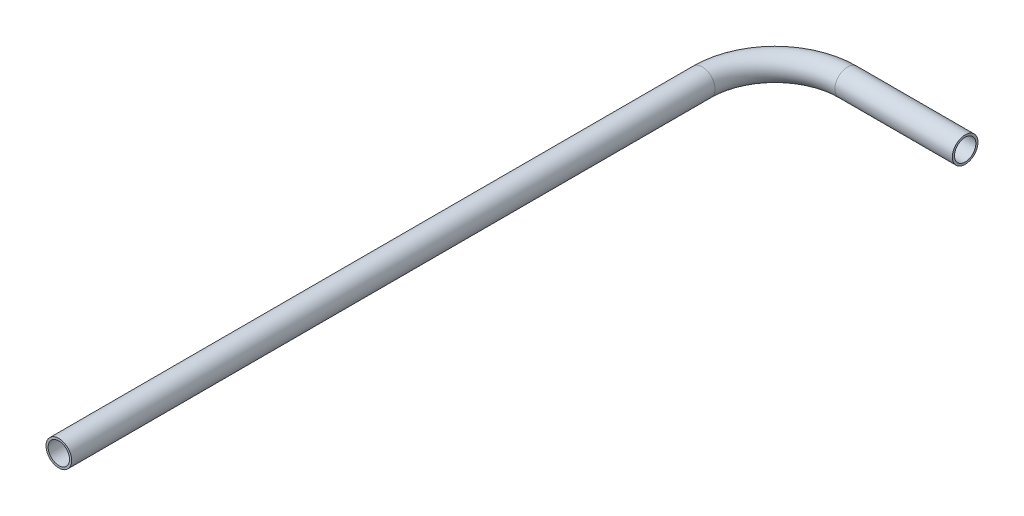
ISO-10303-21;
HEADER;
FILE_DESCRIPTION(('STEP AP214'),'2;1');
FILE_NAME('part.step','',(''),(''),'','','');
FILE_SCHEMA(('AUTOMOTIVE_DESIGN { 1 0 10303 214 1 1 1 1 }'));
ENDSEC;
DATA;
#1=APPLICATION_CONTEXT('core data for automotive mechanical design processes');
#2=APPLICATION_PROTOCOL_DEFINITION('international standard','automotive_design',2000,#1);
#3=PRODUCT_CONTEXT('',#1,'mechanical');
#4=PRODUCT('Part','Part','',(#3));
#5=PRODUCT_RELATED_PRODUCT_CATEGORY('part','',(#4));
#6=PRODUCT_DEFINITION_FORMATION('','',#4);
#7=PRODUCT_DEFINITION_CONTEXT('part definition',#1,'design');
#8=PRODUCT_DEFINITION('design','',#6,#7);
#9=PRODUCT_DEFINITION_SHAPE('','',#8);
#10=(LENGTH_UNIT() NAMED_UNIT(*) SI_UNIT(.MILLI.,.METRE.));
#11=(NAMED_UNIT(*) PLANE_ANGLE_UNIT() SI_UNIT($,.RADIAN.));
#12=(NAMED_UNIT(*) SI_UNIT($,.STERADIAN.) SOLID_ANGLE_UNIT());
#13=UNCERTAINTY_MEASURE_WITH_UNIT(LENGTH_MEASURE(1.E-05),#10,'distance_accuracy_value','');
#14=(GEOMETRIC_REPRESENTATION_CONTEXT(3) GLOBAL_UNCERTAINTY_ASSIGNED_CONTEXT((#13)) GLOBAL_UNIT_ASSIGNED_CONTEXT((#10,
#11,#12)) REPRESENTATION_CONTEXT('',''));
#15=CARTESIAN_POINT('',(0.,0.,0.));
#16=DIRECTION('',(0.,0.,1.));
#17=DIRECTION('',(1.,0.,0.));
#18=AXIS2_PLACEMENT_3D('',#15,#16,#17);
#19=CARTESIAN_POINT('',(0.,0.,0.));
#20=DIRECTION('',(0.,0.,-1.));
#21=DIRECTION('',(-1.,0.,0.));
#22=AXIS2_PLACEMENT_3D('',#19,#20,#21);
#23=CYLINDRICAL_SURFACE('',#22,3.);
#24=CARTESIAN_POINT('',(0.,0.,-150.5));
#25=DIRECTION('',(0.,0.,1.));
#26=DIRECTION('',(1.,0.,0.));
#27=AXIS2_PLACEMENT_3D('',#24,#25,#26);
#28=CIRCLE('',#27,3.);
#29=CARTESIAN_POINT('',(-3.00000000000001,0.,-150.5));
#30=VERTEX_POINT('',#29);
#31=EDGE_CURVE('E70',#30,#30,#28,.T.);
#32=ORIENTED_EDGE('',*,*,#31,.T.);
#33=EDGE_LOOP('',(#32));
#34=FACE_BOUND('',#33,.T.);
#35=CARTESIAN_POINT('',(0.,0.,0.));
#36=DIRECTION('',(0.,0.,1.));
#37=DIRECTION('',(1.,0.,0.));
#38=AXIS2_PLACEMENT_3D('',#35,#36,#37);
#39=CIRCLE('',#38,3.);
#40=CARTESIAN_POINT('',(3.,0.,0.));
#41=VERTEX_POINT('',#40);
#42=EDGE_CURVE('E67',#41,#41,#39,.T.);
#43=ORIENTED_EDGE('',*,*,#42,.F.);
#44=EDGE_LOOP('',(#43));
#45=FACE_BOUND('',#44,.T.);
#46=ADVANCED_FACE('F43',(#34,#45),#23,.T.);
#47=CARTESIAN_POINT('',(17.,0.,-150.5));
#48=DIRECTION('',(0.,-1.,0.));
#49=DIRECTION('',(0.,0.,-1.));
#50=AXIS2_PLACEMENT_3D('',#47,#48,#49);
#51=TOROIDAL_SURFACE('',#50,17.,3.);
#52=CARTESIAN_POINT('',(17.,0.,-167.5));
#53=DIRECTION('',(-1.,0.,0.));
#54=DIRECTION('',(0.,0.,1.));
#55=AXIS2_PLACEMENT_3D('',#52,#53,#54);
#56=CIRCLE('',#55,3.);
#57=CARTESIAN_POINT('',(17.,0.,-170.5));
#58=VERTEX_POINT('',#57);
#59=EDGE_CURVE('E47',#58,#58,#56,.T.);
#60=CARTESIAN_POINT('',(17.,0.,-150.5));
#61=DIRECTION('',(0.,-1.,0.));
#62=DIRECTION('',(0.,0.,-1.));
#63=AXIS2_PLACEMENT_3D('',#60,#61,#62);
#64=CIRCLE('',#63,20.);
#65=EDGE_CURVE('',#30,#58,#64,.T.);
#66=ORIENTED_EDGE('',*,*,#31,.F.);
#67=ORIENTED_EDGE('',*,*,#59,.T.);
#68=ORIENTED_EDGE('',*,*,#65,.T.);
#69=ORIENTED_EDGE('',*,*,#65,.F.);
#70=EDGE_LOOP('',(#66,#68,#67,#69));
#71=FACE_BOUND('',#70,.T.);
#72=ADVANCED_FACE('F79',(#71),#51,.T.);
#73=CARTESIAN_POINT('',(17.,0.,-167.5));
#74=DIRECTION('',(1.,0.,0.));
#75=DIRECTION('',(0.,0.,-1.));
#76=AXIS2_PLACEMENT_3D('',#73,#74,#75);
#77=CYLINDRICAL_SURFACE('',#76,3.);
#78=CARTESIAN_POINT('',(44.5,0.,-167.5));
#79=DIRECTION('',(-1.,0.,0.));
#80=DIRECTION('',(0.,0.,1.));
#81=AXIS2_PLACEMENT_3D('',#78,#79,#80);
#82=CIRCLE('',#81,3.);
#83=CARTESIAN_POINT('',(44.5,0.,-164.5));
#84=VERTEX_POINT('',#83);
#85=EDGE_CURVE('E62',#84,#84,#82,.T.);
#86=ORIENTED_EDGE('',*,*,#85,.T.);
#87=EDGE_LOOP('',(#86));
#88=FACE_BOUND('',#87,.T.);
#89=ORIENTED_EDGE('',*,*,#59,.F.);
#90=EDGE_LOOP('',(#89));
#91=FACE_BOUND('',#90,.T.);
#92=ADVANCED_FACE('F45',(#88,#91),#77,.T.);
#93=CARTESIAN_POINT('',(0.,0.,0.));
#94=DIRECTION('',(0.,0.,1.));
#95=DIRECTION('',(1.,0.,0.));
#96=AXIS2_PLACEMENT_3D('',#93,#94,#95);
#97=PLANE('',#96);
#98=CARTESIAN_POINT('',(0.,0.,0.));
#99=DIRECTION('',(0.,0.,1.));
#100=DIRECTION('',(1.,0.,0.));
#101=AXIS2_PLACEMENT_3D('',#98,#99,#100);
#102=CIRCLE('',#101,2.5);
#103=CARTESIAN_POINT('',(2.5,0.,0.));
#104=VERTEX_POINT('',#103);
#105=EDGE_CURVE('E66',#104,#104,#102,.F.);
#106=ORIENTED_EDGE('',*,*,#105,.T.);
#107=EDGE_LOOP('',(#106));
#108=FACE_BOUND('',#107,.T.);
#109=ORIENTED_EDGE('',*,*,#42,.T.);
#110=EDGE_LOOP('',(#109));
#111=FACE_BOUND('',#110,.T.);
#112=ADVANCED_FACE('F83',(#108,#111),#97,.T.);
#113=CARTESIAN_POINT('',(44.5,0.,-167.5));
#114=DIRECTION('',(-1.,0.,0.));
#115=DIRECTION('',(0.,0.,1.));
#116=AXIS2_PLACEMENT_3D('',#113,#114,#115);
#117=PLANE('',#116);
#118=CARTESIAN_POINT('',(44.5,0.,-167.5));
#119=DIRECTION('',(-1.,0.,0.));
#120=DIRECTION('',(0.,0.,1.));
#121=AXIS2_PLACEMENT_3D('',#118,#119,#120);
#122=CIRCLE('',#121,2.5);
#123=CARTESIAN_POINT('',(44.5,0.,-165.));
#124=VERTEX_POINT('',#123);
#125=EDGE_CURVE('E10',#124,#124,#122,.F.);
#126=ORIENTED_EDGE('',*,*,#125,.F.);
#127=EDGE_LOOP('',(#126));
#128=FACE_BOUND('',#127,.T.);
#129=ORIENTED_EDGE('',*,*,#85,.F.);
#130=EDGE_LOOP('',(#129));
#131=FACE_BOUND('',#130,.T.);
#132=ADVANCED_FACE('F89',(#128,#131),#117,.F.);
#133=CARTESIAN_POINT('',(0.,0.,0.));
#134=DIRECTION('',(0.,0.,-1.));
#135=DIRECTION('',(-1.,0.,0.));
#136=AXIS2_PLACEMENT_3D('',#133,#134,#135);
#137=CYLINDRICAL_SURFACE('',#136,2.5);
#138=CARTESIAN_POINT('',(0.,0.,-150.5));
#139=DIRECTION('',(0.,0.,1.));
#140=DIRECTION('',(1.,0.,0.));
#141=AXIS2_PLACEMENT_3D('',#138,#139,#140);
#142=CIRCLE('',#141,2.5);
#143=CARTESIAN_POINT('',(-2.50000000000001,0.,-150.5));
#144=VERTEX_POINT('',#143);
#145=EDGE_CURVE('E58',#144,#144,#142,.F.);
#146=ORIENTED_EDGE('',*,*,#145,.T.);
#147=EDGE_LOOP('',(#146));
#148=FACE_BOUND('',#147,.T.);
#149=ORIENTED_EDGE('',*,*,#105,.F.);
#150=EDGE_LOOP('',(#149));
#151=FACE_BOUND('',#150,.T.);
#152=ADVANCED_FACE('F99',(#148,#151),#137,.F.);
#153=CARTESIAN_POINT('',(17.,0.,-150.5));
#154=DIRECTION('',(0.,-1.,0.));
#155=DIRECTION('',(0.,0.,-1.));
#156=AXIS2_PLACEMENT_3D('',#153,#154,#155);
#157=TOROIDAL_SURFACE('',#156,17.,2.5);
#158=CARTESIAN_POINT('',(17.,0.,-167.5));
#159=DIRECTION('',(-1.,0.,0.));
#160=DIRECTION('',(0.,0.,1.));
#161=AXIS2_PLACEMENT_3D('',#158,#159,#160);
#162=CIRCLE('',#161,2.5);
#163=CARTESIAN_POINT('',(17.,0.,-170.));
#164=VERTEX_POINT('',#163);
#165=EDGE_CURVE('E52',#164,#164,#162,.F.);
#166=CARTESIAN_POINT('',(17.,0.,-150.5));
#167=DIRECTION('',(0.,-1.,0.));
#168=DIRECTION('',(0.,0.,-1.));
#169=AXIS2_PLACEMENT_3D('',#166,#167,#168);
#170=CIRCLE('',#169,19.5);
#171=EDGE_CURVE('',#144,#164,#170,.T.);
#172=ORIENTED_EDGE('',*,*,#145,.F.);
#173=ORIENTED_EDGE('',*,*,#165,.T.);
#174=ORIENTED_EDGE('',*,*,#171,.T.);
#175=ORIENTED_EDGE('',*,*,#171,.F.);
#176=EDGE_LOOP('',(#172,#174,#173,#175));
#177=FACE_BOUND('',#176,.T.);
#178=ADVANCED_FACE('F94',(#177),#157,.F.);
#179=CARTESIAN_POINT('',(17.,0.,-167.5));
#180=DIRECTION('',(1.,0.,0.));
#181=DIRECTION('',(0.,0.,-1.));
#182=AXIS2_PLACEMENT_3D('',#179,#180,#181);
#183=CYLINDRICAL_SURFACE('',#182,2.5);
#184=ORIENTED_EDGE('',*,*,#125,.T.);
#185=EDGE_LOOP('',(#184));
#186=FACE_BOUND('',#185,.T.);
#187=ORIENTED_EDGE('',*,*,#165,.F.);
#188=EDGE_LOOP('',(#187));
#189=FACE_BOUND('',#188,.T.);
#190=ADVANCED_FACE('F92',(#186,#189),#183,.F.);
#191=CLOSED_SHELL('',(#46,#72,#92,#112,#132,#152,#178,#190));
#192=MANIFOLD_SOLID_BREP('B2',#191);
#193=ADVANCED_BREP_SHAPE_REPRESENTATION('',(#18,#192),#14);
#194=SHAPE_DEFINITION_REPRESENTATION(#9,#193);
ENDSEC;
END-ISO-10303-21;
